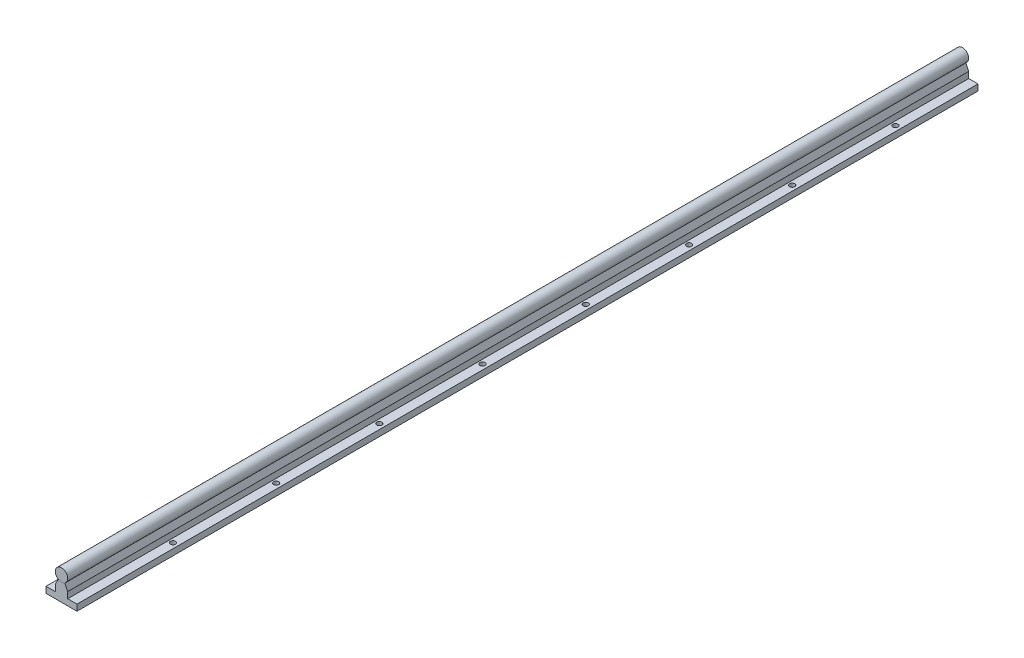
ISO-10303-21;
HEADER;
FILE_DESCRIPTION(('STEP AP214'),'2;1');
FILE_NAME('part.step','',(''),(''),'','','');
FILE_SCHEMA(('AUTOMOTIVE_DESIGN { 1 0 10303 214 1 1 1 1 }'));
ENDSEC;
DATA;
#1=APPLICATION_CONTEXT('core data for automotive mechanical design processes');
#2=APPLICATION_PROTOCOL_DEFINITION('international standard','automotive_design',2000,#1);
#3=PRODUCT_CONTEXT('',#1,'mechanical');
#4=PRODUCT('Part','Part','',(#3));
#5=PRODUCT_RELATED_PRODUCT_CATEGORY('part','',(#4));
#6=PRODUCT_DEFINITION_FORMATION('','',#4);
#7=PRODUCT_DEFINITION_CONTEXT('part definition',#1,'design');
#8=PRODUCT_DEFINITION('design','',#6,#7);
#9=PRODUCT_DEFINITION_SHAPE('','',#8);
#10=(LENGTH_UNIT() NAMED_UNIT(*) SI_UNIT(.MILLI.,.METRE.));
#11=(NAMED_UNIT(*) PLANE_ANGLE_UNIT() SI_UNIT($,.RADIAN.));
#12=(NAMED_UNIT(*) SI_UNIT($,.STERADIAN.) SOLID_ANGLE_UNIT());
#13=UNCERTAINTY_MEASURE_WITH_UNIT(LENGTH_MEASURE(1.E-05),#10,'distance_accuracy_value','');
#14=(GEOMETRIC_REPRESENTATION_CONTEXT(3) GLOBAL_UNCERTAINTY_ASSIGNED_CONTEXT((#13)) GLOBAL_UNIT_ASSIGNED_CONTEXT((#10,
#11,#12)) REPRESENTATION_CONTEXT('',''));
#15=CARTESIAN_POINT('',(0.,0.,0.));
#16=DIRECTION('',(0.,0.,1.));
#17=DIRECTION('',(1.,0.,0.));
#18=AXIS2_PLACEMENT_3D('',#15,#16,#17);
#19=CARTESIAN_POINT('',(0.,-23.,907.946962289385));
#20=DIRECTION('',(0.,1.,0.));
#21=DIRECTION('',(-1.,0.,0.));
#22=AXIS2_PLACEMENT_3D('',#19,#20,#21);
#23=PLANE('',#22);
#24=CARTESIAN_POINT('',(-10.,-23.,475.));
#25=DIRECTION('',(0.,-1.,0.));
#26=DIRECTION('',(0.,0.,-1.));
#27=AXIS2_PLACEMENT_3D('',#24,#25,#26);
#28=CIRCLE('',#27,2.5);
#29=CARTESIAN_POINT('',(-10.,-23.,472.5));
#30=VERTEX_POINT('',#29);
#31=EDGE_CURVE('E462',#30,#30,#28,.T.);
#32=ORIENTED_EDGE('',*,*,#31,.F.);
#33=EDGE_LOOP('',(#32));
#34=FACE_BOUND('',#33,.T.);
#35=CARTESIAN_POINT('',(9.99999999999999,-23.,375.));
#36=DIRECTION('',(0.,-1.,0.));
#37=DIRECTION('',(0.,0.,-1.));
#38=AXIS2_PLACEMENT_3D('',#35,#36,#37);
#39=CIRCLE('',#38,2.5);
#40=CARTESIAN_POINT('',(9.99999999999999,-23.,372.5));
#41=VERTEX_POINT('',#40);
#42=EDGE_CURVE('E468',#41,#41,#39,.T.);
#43=ORIENTED_EDGE('',*,*,#42,.F.);
#44=EDGE_LOOP('',(#43));
#45=FACE_BOUND('',#44,.T.);
#46=CARTESIAN_POINT('',(9.99999999999999,-23.,75.));
#47=DIRECTION('',(0.,-1.,0.));
#48=DIRECTION('',(0.,0.,-1.));
#49=AXIS2_PLACEMENT_3D('',#46,#47,#48);
#50=CIRCLE('',#49,2.5);
#51=CARTESIAN_POINT('',(9.99999999999999,-23.,72.5));
#52=VERTEX_POINT('',#51);
#53=EDGE_CURVE('E346',#52,#52,#50,.T.);
#54=ORIENTED_EDGE('',*,*,#53,.F.);
#55=EDGE_LOOP('',(#54));
#56=FACE_BOUND('',#55,.T.);
#57=CARTESIAN_POINT('',(-10.,-23.,75.));
#58=DIRECTION('',(0.,-1.,0.));
#59=DIRECTION('',(0.,0.,-1.));
#60=AXIS2_PLACEMENT_3D('',#57,#58,#59);
#61=CIRCLE('',#60,2.5);
#62=CARTESIAN_POINT('',(-10.,-23.,72.5));
#63=VERTEX_POINT('',#62);
#64=EDGE_CURVE('E345',#63,#63,#61,.T.);
#65=ORIENTED_EDGE('',*,*,#64,.F.);
#66=EDGE_LOOP('',(#65));
#67=FACE_BOUND('',#66,.T.);
#68=DIRECTION('',(1.,0.,0.));
#69=VECTOR('',#68,1.);
#70=CARTESIAN_POINT('',(0.,-23.,873.));
#71=LINE('',#70,#69);
#72=CARTESIAN_POINT('',(-15.,-23.,873.));
#73=VERTEX_POINT('',#72);
#74=CARTESIAN_POINT('',(15.,-23.,873.));
#75=VERTEX_POINT('',#74);
#76=EDGE_CURVE('E178',#73,#75,#71,.T.);
#77=ORIENTED_EDGE('',*,*,#76,.F.);
#78=DIRECTION('',(0.,0.,-1.));
#79=VECTOR('',#78,1.);
#80=CARTESIAN_POINT('',(-15.,-23.,907.946962289385));
#81=LINE('',#80,#79);
#82=CARTESIAN_POINT('',(-15.,-23.,0.));
#83=VERTEX_POINT('',#82);
#84=EDGE_CURVE('E205',#73,#83,#81,.T.);
#85=ORIENTED_EDGE('',*,*,#84,.T.);
#86=DIRECTION('',(1.,0.,0.));
#87=VECTOR('',#86,1.);
#88=CARTESIAN_POINT('',(0.,-23.,0.));
#89=LINE('',#88,#87);
#90=CARTESIAN_POINT('',(15.,-23.,0.));
#91=VERTEX_POINT('',#90);
#92=EDGE_CURVE('E207',#83,#91,#89,.T.);
#93=ORIENTED_EDGE('',*,*,#92,.T.);
#94=DIRECTION('',(0.,0.,-1.));
#95=VECTOR('',#94,1.);
#96=CARTESIAN_POINT('',(15.,-23.,907.946962289385));
#97=LINE('',#96,#95);
#98=EDGE_CURVE('E208',#75,#91,#97,.T.);
#99=ORIENTED_EDGE('',*,*,#98,.F.);
#100=EDGE_LOOP('',(#77,#85,#93,#99));
#101=FACE_BOUND('',#100,.T.);
#102=CARTESIAN_POINT('',(-10.,-23.,175.));
#103=DIRECTION('',(0.,-1.,0.));
#104=DIRECTION('',(0.,0.,-1.));
#105=AXIS2_PLACEMENT_3D('',#102,#103,#104);
#106=CIRCLE('',#105,2.5);
#107=CARTESIAN_POINT('',(-10.,-23.,172.5));
#108=VERTEX_POINT('',#107);
#109=EDGE_CURVE('E492',#108,#108,#106,.T.);
#110=ORIENTED_EDGE('',*,*,#109,.F.);
#111=EDGE_LOOP('',(#110));
#112=FACE_BOUND('',#111,.T.);
#113=CARTESIAN_POINT('',(9.99999999999999,-23.,175.));
#114=DIRECTION('',(0.,-1.,0.));
#115=DIRECTION('',(0.,0.,-1.));
#116=AXIS2_PLACEMENT_3D('',#113,#114,#115);
#117=CIRCLE('',#116,2.5);
#118=CARTESIAN_POINT('',(9.99999999999999,-23.,172.5));
#119=VERTEX_POINT('',#118);
#120=EDGE_CURVE('E488',#119,#119,#117,.T.);
#121=ORIENTED_EDGE('',*,*,#120,.F.);
#122=EDGE_LOOP('',(#121));
#123=FACE_BOUND('',#122,.T.);
#124=CARTESIAN_POINT('',(-10.,-23.,275.));
#125=DIRECTION('',(0.,-1.,0.));
#126=DIRECTION('',(0.,0.,-1.));
#127=AXIS2_PLACEMENT_3D('',#124,#125,#126);
#128=CIRCLE('',#127,2.5);
#129=CARTESIAN_POINT('',(-10.,-23.,272.5));
#130=VERTEX_POINT('',#129);
#131=EDGE_CURVE('E482',#130,#130,#128,.T.);
#132=ORIENTED_EDGE('',*,*,#131,.F.);
#133=EDGE_LOOP('',(#132));
#134=FACE_BOUND('',#133,.T.);
#135=CARTESIAN_POINT('',(9.99999999999999,-23.,275.));
#136=DIRECTION('',(0.,-1.,0.));
#137=DIRECTION('',(0.,0.,-1.));
#138=AXIS2_PLACEMENT_3D('',#135,#136,#137);
#139=CIRCLE('',#138,2.5);
#140=CARTESIAN_POINT('',(9.99999999999999,-23.,272.5));
#141=VERTEX_POINT('',#140);
#142=EDGE_CURVE('E478',#141,#141,#139,.T.);
#143=ORIENTED_EDGE('',*,*,#142,.F.);
#144=EDGE_LOOP('',(#143));
#145=FACE_BOUND('',#144,.T.);
#146=CARTESIAN_POINT('',(-10.,-23.,375.));
#147=DIRECTION('',(0.,-1.,0.));
#148=DIRECTION('',(0.,0.,-1.));
#149=AXIS2_PLACEMENT_3D('',#146,#147,#148);
#150=CIRCLE('',#149,2.5);
#151=CARTESIAN_POINT('',(-10.,-23.,372.5));
#152=VERTEX_POINT('',#151);
#153=EDGE_CURVE('E472',#152,#152,#150,.T.);
#154=ORIENTED_EDGE('',*,*,#153,.F.);
#155=EDGE_LOOP('',(#154));
#156=FACE_BOUND('',#155,.T.);
#157=CARTESIAN_POINT('',(9.99999999999999,-23.,475.));
#158=DIRECTION('',(0.,-1.,0.));
#159=DIRECTION('',(0.,0.,-1.));
#160=AXIS2_PLACEMENT_3D('',#157,#158,#159);
#161=CIRCLE('',#160,2.5);
#162=CARTESIAN_POINT('',(9.99999999999999,-23.,472.5));
#163=VERTEX_POINT('',#162);
#164=EDGE_CURVE('E458',#163,#163,#161,.T.);
#165=ORIENTED_EDGE('',*,*,#164,.F.);
#166=EDGE_LOOP('',(#165));
#167=FACE_BOUND('',#166,.T.);
#168=CARTESIAN_POINT('',(-10.,-23.,575.));
#169=DIRECTION('',(0.,-1.,0.));
#170=DIRECTION('',(0.,0.,-1.));
#171=AXIS2_PLACEMENT_3D('',#168,#169,#170);
#172=CIRCLE('',#171,2.5);
#173=CARTESIAN_POINT('',(-10.,-23.,572.5));
#174=VERTEX_POINT('',#173);
#175=EDGE_CURVE('E452',#174,#174,#172,.T.);
#176=ORIENTED_EDGE('',*,*,#175,.F.);
#177=EDGE_LOOP('',(#176));
#178=FACE_BOUND('',#177,.T.);
#179=CARTESIAN_POINT('',(9.99999999999999,-23.,575.));
#180=DIRECTION('',(0.,-1.,0.));
#181=DIRECTION('',(0.,0.,-1.));
#182=AXIS2_PLACEMENT_3D('',#179,#180,#181);
#183=CIRCLE('',#182,2.5);
#184=CARTESIAN_POINT('',(9.99999999999999,-23.,572.5));
#185=VERTEX_POINT('',#184);
#186=EDGE_CURVE('E448',#185,#185,#183,.T.);
#187=ORIENTED_EDGE('',*,*,#186,.F.);
#188=EDGE_LOOP('',(#187));
#189=FACE_BOUND('',#188,.T.);
#190=CARTESIAN_POINT('',(-10.,-23.,675.));
#191=DIRECTION('',(0.,-1.,0.));
#192=DIRECTION('',(0.,0.,-1.));
#193=AXIS2_PLACEMENT_3D('',#190,#191,#192);
#194=CIRCLE('',#193,2.5);
#195=CARTESIAN_POINT('',(-10.,-23.,672.5));
#196=VERTEX_POINT('',#195);
#197=EDGE_CURVE('E442',#196,#196,#194,.T.);
#198=ORIENTED_EDGE('',*,*,#197,.F.);
#199=EDGE_LOOP('',(#198));
#200=FACE_BOUND('',#199,.T.);
#201=CARTESIAN_POINT('',(9.99999999999999,-23.,675.));
#202=DIRECTION('',(0.,-1.,0.));
#203=DIRECTION('',(0.,0.,-1.));
#204=AXIS2_PLACEMENT_3D('',#201,#202,#203);
#205=CIRCLE('',#204,2.5);
#206=CARTESIAN_POINT('',(9.99999999999999,-23.,672.5));
#207=VERTEX_POINT('',#206);
#208=EDGE_CURVE('E438',#207,#207,#205,.T.);
#209=ORIENTED_EDGE('',*,*,#208,.F.);
#210=EDGE_LOOP('',(#209));
#211=FACE_BOUND('',#210,.T.);
#212=CARTESIAN_POINT('',(-10.,-23.,775.));
#213=DIRECTION('',(0.,-1.,0.));
#214=DIRECTION('',(0.,0.,-1.));
#215=AXIS2_PLACEMENT_3D('',#212,#213,#214);
#216=CIRCLE('',#215,2.5);
#217=CARTESIAN_POINT('',(-10.,-23.,772.5));
#218=VERTEX_POINT('',#217);
#219=EDGE_CURVE('E429',#218,#218,#216,.T.);
#220=ORIENTED_EDGE('',*,*,#219,.F.);
#221=EDGE_LOOP('',(#220));
#222=FACE_BOUND('',#221,.T.);
#223=CARTESIAN_POINT('',(9.99999999999999,-23.,775.));
#224=DIRECTION('',(0.,-1.,0.));
#225=DIRECTION('',(0.,0.,-1.));
#226=AXIS2_PLACEMENT_3D('',#223,#224,#225);
#227=CIRCLE('',#226,2.5);
#228=CARTESIAN_POINT('',(9.99999999999999,-23.,772.5));
#229=VERTEX_POINT('',#228);
#230=EDGE_CURVE('E428',#229,#229,#227,.T.);
#231=ORIENTED_EDGE('',*,*,#230,.F.);
#232=EDGE_LOOP('',(#231));
#233=FACE_BOUND('',#232,.T.);
#234=ADVANCED_FACE('F51',(#34,#45,#56,#67,#101,#112,#123,#134,#145,#156,#167,#178,#189,#200,
#211,#222,#233),#23,.F.);
#235=CARTESIAN_POINT('',(0.,0.,907.946962289385));
#236=DIRECTION('',(0.,0.,-1.));
#237=DIRECTION('',(-1.,0.,0.));
#238=AXIS2_PLACEMENT_3D('',#235,#236,#237);
#239=CYLINDRICAL_SURFACE('',#238,6.);
#240=DIRECTION('',(0.,0.,-1.));
#241=VECTOR('',#240,1.);
#242=CARTESIAN_POINT('',(-3.2,-5.07543101617981,907.946962289385));
#243=LINE('',#242,#241);
#244=CARTESIAN_POINT('',(-3.2,-5.07543101617981,873.));
#245=VERTEX_POINT('',#244);
#246=CARTESIAN_POINT('',(-3.2,-5.07543101617981,0.));
#247=VERTEX_POINT('',#246);
#248=EDGE_CURVE('E122',#245,#247,#243,.T.);
#249=ORIENTED_EDGE('',*,*,#248,.F.);
#250=CARTESIAN_POINT('',(0.,0.,873.));
#251=DIRECTION('',(0.,0.,1.));
#252=DIRECTION('',(1.,0.,0.));
#253=AXIS2_PLACEMENT_3D('',#250,#251,#252);
#254=CIRCLE('',#253,6.);
#255=CARTESIAN_POINT('',(3.2,-5.07543101617981,873.));
#256=VERTEX_POINT('',#255);
#257=EDGE_CURVE('E196',#245,#256,#254,.T.);
#258=ORIENTED_EDGE('',*,*,#257,.T.);
#259=DIRECTION('',(0.,0.,-1.));
#260=VECTOR('',#259,1.);
#261=CARTESIAN_POINT('',(3.2,-5.07543101617981,907.946962289385));
#262=LINE('',#261,#260);
#263=CARTESIAN_POINT('',(3.2,-5.07543101617981,0.));
#264=VERTEX_POINT('',#263);
#265=EDGE_CURVE('E55',#256,#264,#262,.T.);
#266=ORIENTED_EDGE('',*,*,#265,.T.);
#267=CARTESIAN_POINT('',(0.,0.,0.));
#268=DIRECTION('',(0.,0.,1.));
#269=DIRECTION('',(1.,0.,0.));
#270=AXIS2_PLACEMENT_3D('',#267,#268,#269);
#271=CIRCLE('',#270,6.);
#272=EDGE_CURVE('E210',#247,#264,#271,.T.);
#273=ORIENTED_EDGE('',*,*,#272,.F.);
#274=EDGE_LOOP('',(#249,#258,#266,#273));
#275=FACE_BOUND('',#274,.T.);
#276=ADVANCED_FACE('F240',(#275),#239,.F.);
#277=CARTESIAN_POINT('',(-0.684457312309336,0.319167686410031,907.946962289385));
#278=DIRECTION('',(-0.90630778703665,0.4226182617407,0.));
#279=DIRECTION('',(-0.4226182617407,-0.90630778703665,0.));
#280=AXIS2_PLACEMENT_3D('',#277,#278,#279);
#281=PLANE('',#280);
#282=DIRECTION('',(0.,0.,-1.));
#283=VECTOR('',#282,1.);
#284=CARTESIAN_POINT('',(-5.96267188842293,-11.,907.946962289385));
#285=LINE('',#284,#283);
#286=CARTESIAN_POINT('',(-5.96267188842293,-11.,873.));
#287=VERTEX_POINT('',#286);
#288=CARTESIAN_POINT('',(-5.96267188842293,-11.,0.));
#289=VERTEX_POINT('',#288);
#290=EDGE_CURVE('E194',#287,#289,#285,.T.);
#291=ORIENTED_EDGE('',*,*,#290,.F.);
#292=DIRECTION('',(0.4226182617407,0.90630778703665,0.));
#293=VECTOR('',#292,1.);
#294=CARTESIAN_POINT('',(-0.684457312309336,0.319167686410031,873.));
#295=LINE('',#294,#293);
#296=EDGE_CURVE('E129',#287,#245,#295,.T.);
#297=ORIENTED_EDGE('',*,*,#296,.T.);
#298=ORIENTED_EDGE('',*,*,#248,.T.);
#299=DIRECTION('',(0.4226182617407,0.90630778703665,0.));
#300=VECTOR('',#299,1.);
#301=CARTESIAN_POINT('',(-0.684457312309336,0.319167686410031,0.));
#302=LINE('',#301,#300);
#303=EDGE_CURVE('E191',#289,#247,#302,.T.);
#304=ORIENTED_EDGE('',*,*,#303,.F.);
#305=EDGE_LOOP('',(#291,#297,#298,#304));
#306=FACE_BOUND('',#305,.T.);
#307=ADVANCED_FACE('F258',(#306),#281,.T.);
#308=CARTESIAN_POINT('',(0.,-11.,907.946962289385));
#309=DIRECTION('',(0.,1.,0.));
#310=DIRECTION('',(0.,0.,1.));
#311=AXIS2_PLACEMENT_3D('',#308,#309,#310);
#312=PLANE('',#311);
#313=DIRECTION('',(0.,0.,-1.));
#314=VECTOR('',#313,1.);
#315=CARTESIAN_POINT('',(-6.,-11.,907.946962289385));
#316=LINE('',#315,#314);
#317=CARTESIAN_POINT('',(-6.,-11.,873.));
#318=VERTEX_POINT('',#317);
#319=CARTESIAN_POINT('',(-6.,-11.,0.));
#320=VERTEX_POINT('',#319);
#321=EDGE_CURVE('E201',#318,#320,#316,.T.);
#322=ORIENTED_EDGE('',*,*,#321,.F.);
#323=DIRECTION('',(1.,0.,0.));
#324=VECTOR('',#323,1.);
#325=CARTESIAN_POINT('',(0.,-11.,873.));
#326=LINE('',#325,#324);
#327=EDGE_CURVE('E192',#318,#287,#326,.T.);
#328=ORIENTED_EDGE('',*,*,#327,.T.);
#329=ORIENTED_EDGE('',*,*,#290,.T.);
#330=DIRECTION('',(1.,0.,0.));
#331=VECTOR('',#330,1.);
#332=CARTESIAN_POINT('',(0.,-11.,0.));
#333=LINE('',#332,#331);
#334=EDGE_CURVE('E230',#320,#289,#333,.T.);
#335=ORIENTED_EDGE('',*,*,#334,.F.);
#336=EDGE_LOOP('',(#322,#328,#329,#335));
#337=FACE_BOUND('',#336,.T.);
#338=ADVANCED_FACE('F275',(#337),#312,.T.);
#339=CARTESIAN_POINT('',(-6.,0.,907.946962289385));
#340=DIRECTION('',(1.,0.,0.));
#341=DIRECTION('',(0.,1.,0.));
#342=AXIS2_PLACEMENT_3D('',#339,#340,#341);
#343=PLANE('',#342);
#344=DIRECTION('',(0.,-1.,0.));
#345=VECTOR('',#344,1.);
#346=CARTESIAN_POINT('',(-6.,0.,873.));
#347=LINE('',#346,#345);
#348=CARTESIAN_POINT('',(-6.,-17.,873.));
#349=VERTEX_POINT('',#348);
#350=EDGE_CURVE('E181',#318,#349,#347,.T.);
#351=ORIENTED_EDGE('',*,*,#350,.F.);
#352=ORIENTED_EDGE('',*,*,#321,.T.);
#353=DIRECTION('',(0.,-1.,0.));
#354=VECTOR('',#353,1.);
#355=CARTESIAN_POINT('',(-6.,0.,0.));
#356=LINE('',#355,#354);
#357=CARTESIAN_POINT('',(-6.,-17.,0.));
#358=VERTEX_POINT('',#357);
#359=EDGE_CURVE('E188',#320,#358,#356,.T.);
#360=ORIENTED_EDGE('',*,*,#359,.T.);
#361=DIRECTION('',(0.,0.,-1.));
#362=VECTOR('',#361,1.);
#363=CARTESIAN_POINT('',(-6.,-17.,907.946962289385));
#364=LINE('',#363,#362);
#365=EDGE_CURVE('E185',#349,#358,#364,.T.);
#366=ORIENTED_EDGE('',*,*,#365,.F.);
#367=EDGE_LOOP('',(#351,#352,#360,#366));
#368=FACE_BOUND('',#367,.T.);
#369=ADVANCED_FACE('F271',(#368),#343,.F.);
#370=CARTESIAN_POINT('',(0.,-17.,907.946962289385));
#371=DIRECTION('',(0.,1.,0.));
#372=DIRECTION('',(0.,0.,1.));
#373=AXIS2_PLACEMENT_3D('',#370,#371,#372);
#374=PLANE('',#373);
#375=CARTESIAN_POINT('',(-10.,-17.,775.));
#376=DIRECTION('',(0.,1.,0.));
#377=DIRECTION('',(0.,0.,1.));
#378=AXIS2_PLACEMENT_3D('',#375,#376,#377);
#379=CIRCLE('',#378,2.5);
#380=CARTESIAN_POINT('',(-10.,-17.,777.5));
#381=VERTEX_POINT('',#380);
#382=EDGE_CURVE('E432',#381,#381,#379,.T.);
#383=ORIENTED_EDGE('',*,*,#382,.F.);
#384=EDGE_LOOP('',(#383));
#385=FACE_BOUND('',#384,.T.);
#386=CARTESIAN_POINT('',(-10.,-17.,675.));
#387=DIRECTION('',(0.,1.,0.));
#388=DIRECTION('',(0.,0.,1.));
#389=AXIS2_PLACEMENT_3D('',#386,#387,#388);
#390=CIRCLE('',#389,2.5);
#391=CARTESIAN_POINT('',(-10.,-17.,677.5));
#392=VERTEX_POINT('',#391);
#393=EDGE_CURVE('E445',#392,#392,#390,.T.);
#394=ORIENTED_EDGE('',*,*,#393,.F.);
#395=EDGE_LOOP('',(#394));
#396=FACE_BOUND('',#395,.T.);
#397=CARTESIAN_POINT('',(-10.,-17.,575.));
#398=DIRECTION('',(0.,1.,0.));
#399=DIRECTION('',(0.,0.,1.));
#400=AXIS2_PLACEMENT_3D('',#397,#398,#399);
#401=CIRCLE('',#400,2.5);
#402=CARTESIAN_POINT('',(-10.,-17.,577.5));
#403=VERTEX_POINT('',#402);
#404=EDGE_CURVE('E455',#403,#403,#401,.T.);
#405=ORIENTED_EDGE('',*,*,#404,.F.);
#406=EDGE_LOOP('',(#405));
#407=FACE_BOUND('',#406,.T.);
#408=CARTESIAN_POINT('',(-10.,-17.,475.));
#409=DIRECTION('',(0.,1.,0.));
#410=DIRECTION('',(0.,0.,1.));
#411=AXIS2_PLACEMENT_3D('',#408,#409,#410);
#412=CIRCLE('',#411,2.5);
#413=CARTESIAN_POINT('',(-10.,-17.,477.5));
#414=VERTEX_POINT('',#413);
#415=EDGE_CURVE('E465',#414,#414,#412,.T.);
#416=ORIENTED_EDGE('',*,*,#415,.F.);
#417=EDGE_LOOP('',(#416));
#418=FACE_BOUND('',#417,.T.);
#419=CARTESIAN_POINT('',(-10.,-17.,375.));
#420=DIRECTION('',(0.,1.,0.));
#421=DIRECTION('',(0.,0.,1.));
#422=AXIS2_PLACEMENT_3D('',#419,#420,#421);
#423=CIRCLE('',#422,2.5);
#424=CARTESIAN_POINT('',(-10.,-17.,377.5));
#425=VERTEX_POINT('',#424);
#426=EDGE_CURVE('E475',#425,#425,#423,.T.);
#427=ORIENTED_EDGE('',*,*,#426,.F.);
#428=EDGE_LOOP('',(#427));
#429=FACE_BOUND('',#428,.T.);
#430=CARTESIAN_POINT('',(-10.,-17.,275.));
#431=DIRECTION('',(0.,1.,0.));
#432=DIRECTION('',(0.,0.,1.));
#433=AXIS2_PLACEMENT_3D('',#430,#431,#432);
#434=CIRCLE('',#433,2.5);
#435=CARTESIAN_POINT('',(-10.,-17.,277.5));
#436=VERTEX_POINT('',#435);
#437=EDGE_CURVE('E485',#436,#436,#434,.T.);
#438=ORIENTED_EDGE('',*,*,#437,.F.);
#439=EDGE_LOOP('',(#438));
#440=FACE_BOUND('',#439,.T.);
#441=CARTESIAN_POINT('',(-10.,-17.,175.));
#442=DIRECTION('',(0.,1.,0.));
#443=DIRECTION('',(0.,0.,1.));
#444=AXIS2_PLACEMENT_3D('',#441,#442,#443);
#445=CIRCLE('',#444,2.5);
#446=CARTESIAN_POINT('',(-10.,-17.,177.5));
#447=VERTEX_POINT('',#446);
#448=EDGE_CURVE('E351',#447,#447,#445,.T.);
#449=ORIENTED_EDGE('',*,*,#448,.F.);
#450=EDGE_LOOP('',(#449));
#451=FACE_BOUND('',#450,.T.);
#452=CARTESIAN_POINT('',(-10.,-17.,75.));
#453=DIRECTION('',(0.,1.,0.));
#454=DIRECTION('',(0.,0.,1.));
#455=AXIS2_PLACEMENT_3D('',#452,#453,#454);
#456=CIRCLE('',#455,2.5);
#457=CARTESIAN_POINT('',(-10.,-17.,77.5));
#458=VERTEX_POINT('',#457);
#459=EDGE_CURVE('E197',#458,#458,#456,.T.);
#460=ORIENTED_EDGE('',*,*,#459,.F.);
#461=EDGE_LOOP('',(#460));
#462=FACE_BOUND('',#461,.T.);
#463=DIRECTION('',(0.,0.,-1.));
#464=VECTOR('',#463,1.);
#465=CARTESIAN_POINT('',(-15.,-17.,907.946962289385));
#466=LINE('',#465,#464);
#467=CARTESIAN_POINT('',(-15.,-17.,873.));
#468=VERTEX_POINT('',#467);
#469=CARTESIAN_POINT('',(-15.,-17.,0.));
#470=VERTEX_POINT('',#469);
#471=EDGE_CURVE('E184',#468,#470,#466,.T.);
#472=ORIENTED_EDGE('',*,*,#471,.F.);
#473=DIRECTION('',(1.,0.,0.));
#474=VECTOR('',#473,1.);
#475=CARTESIAN_POINT('',(0.,-17.,873.));
#476=LINE('',#475,#474);
#477=EDGE_CURVE('E186',#468,#349,#476,.T.);
#478=ORIENTED_EDGE('',*,*,#477,.T.);
#479=ORIENTED_EDGE('',*,*,#365,.T.);
#480=DIRECTION('',(1.,0.,0.));
#481=VECTOR('',#480,1.);
#482=CARTESIAN_POINT('',(0.,-17.,0.));
#483=LINE('',#482,#481);
#484=EDGE_CURVE('E227',#470,#358,#483,.T.);
#485=ORIENTED_EDGE('',*,*,#484,.F.);
#486=EDGE_LOOP('',(#472,#478,#479,#485));
#487=FACE_BOUND('',#486,.T.);
#488=ADVANCED_FACE('F268',(#385,#396,#407,#418,#429,#440,#451,#462,#487),#374,.T.);
#489=CARTESIAN_POINT('',(-15.,0.,907.946962289385));
#490=DIRECTION('',(-1.,0.,0.));
#491=DIRECTION('',(0.,0.,1.));
#492=AXIS2_PLACEMENT_3D('',#489,#490,#491);
#493=PLANE('',#492);
#494=ORIENTED_EDGE('',*,*,#84,.F.);
#495=DIRECTION('',(0.,1.,0.));
#496=VECTOR('',#495,1.);
#497=CARTESIAN_POINT('',(-15.,0.,873.));
#498=LINE('',#497,#496);
#499=EDGE_CURVE('E182',#73,#468,#498,.T.);
#500=ORIENTED_EDGE('',*,*,#499,.T.);
#501=ORIENTED_EDGE('',*,*,#471,.T.);
#502=DIRECTION('',(0.,1.,0.));
#503=VECTOR('',#502,1.);
#504=CARTESIAN_POINT('',(-15.,0.,0.));
#505=LINE('',#504,#503);
#506=EDGE_CURVE('E220',#83,#470,#505,.T.);
#507=ORIENTED_EDGE('',*,*,#506,.F.);
#508=EDGE_LOOP('',(#494,#500,#501,#507));
#509=FACE_BOUND('',#508,.T.);
#510=ADVANCED_FACE('F265',(#509),#493,.T.);
#511=CARTESIAN_POINT('',(15.,0.,907.946962289385));
#512=DIRECTION('',(-1.,0.,0.));
#513=DIRECTION('',(0.,-1.,0.));
#514=AXIS2_PLACEMENT_3D('',#511,#512,#513);
#515=PLANE('',#514);
#516=DIRECTION('',(0.,1.,0.));
#517=VECTOR('',#516,1.);
#518=CARTESIAN_POINT('',(15.,0.,873.));
#519=LINE('',#518,#517);
#520=CARTESIAN_POINT('',(15.,-17.,873.));
#521=VERTEX_POINT('',#520);
#522=EDGE_CURVE('E153',#75,#521,#519,.T.);
#523=ORIENTED_EDGE('',*,*,#522,.F.);
#524=ORIENTED_EDGE('',*,*,#98,.T.);
#525=DIRECTION('',(0.,1.,0.));
#526=VECTOR('',#525,1.);
#527=CARTESIAN_POINT('',(15.,0.,0.));
#528=LINE('',#527,#526);
#529=CARTESIAN_POINT('',(15.,-17.,0.));
#530=VERTEX_POINT('',#529);
#531=EDGE_CURVE('E176',#91,#530,#528,.T.);
#532=ORIENTED_EDGE('',*,*,#531,.T.);
#533=DIRECTION('',(0.,0.,-1.));
#534=VECTOR('',#533,1.);
#535=CARTESIAN_POINT('',(15.,-17.,907.946962289385));
#536=LINE('',#535,#534);
#537=EDGE_CURVE('E169',#521,#530,#536,.T.);
#538=ORIENTED_EDGE('',*,*,#537,.F.);
#539=EDGE_LOOP('',(#523,#524,#532,#538));
#540=FACE_BOUND('',#539,.T.);
#541=ADVANCED_FACE('F263',(#540),#515,.F.);
#542=CARTESIAN_POINT('',(0.,-17.,907.946962289385));
#543=DIRECTION('',(0.,1.,0.));
#544=DIRECTION('',(-1.,0.,0.));
#545=AXIS2_PLACEMENT_3D('',#542,#543,#544);
#546=PLANE('',#545);
#547=CARTESIAN_POINT('',(9.99999999999999,-17.,775.));
#548=DIRECTION('',(0.,1.,0.));
#549=DIRECTION('',(-1.,0.,0.));
#550=AXIS2_PLACEMENT_3D('',#547,#548,#549);
#551=CIRCLE('',#550,2.5);
#552=CARTESIAN_POINT('',(7.5,-17.,775.));
#553=VERTEX_POINT('',#552);
#554=EDGE_CURVE('E316',#553,#553,#551,.T.);
#555=ORIENTED_EDGE('',*,*,#554,.F.);
#556=EDGE_LOOP('',(#555));
#557=FACE_BOUND('',#556,.T.);
#558=CARTESIAN_POINT('',(9.99999999999999,-17.,675.));
#559=DIRECTION('',(0.,1.,0.));
#560=DIRECTION('',(-1.,0.,0.));
#561=AXIS2_PLACEMENT_3D('',#558,#559,#560);
#562=CIRCLE('',#561,2.5);
#563=CARTESIAN_POINT('',(7.5,-17.,675.));
#564=VERTEX_POINT('',#563);
#565=EDGE_CURVE('E320',#564,#564,#562,.T.);
#566=ORIENTED_EDGE('',*,*,#565,.F.);
#567=EDGE_LOOP('',(#566));
#568=FACE_BOUND('',#567,.T.);
#569=CARTESIAN_POINT('',(9.99999999999999,-17.,575.));
#570=DIRECTION('',(0.,1.,0.));
#571=DIRECTION('',(-1.,0.,0.));
#572=AXIS2_PLACEMENT_3D('',#569,#570,#571);
#573=CIRCLE('',#572,2.5);
#574=CARTESIAN_POINT('',(7.5,-17.,575.));
#575=VERTEX_POINT('',#574);
#576=EDGE_CURVE('E324',#575,#575,#573,.T.);
#577=ORIENTED_EDGE('',*,*,#576,.F.);
#578=EDGE_LOOP('',(#577));
#579=FACE_BOUND('',#578,.T.);
#580=CARTESIAN_POINT('',(9.99999999999999,-17.,475.));
#581=DIRECTION('',(0.,1.,0.));
#582=DIRECTION('',(-1.,0.,0.));
#583=AXIS2_PLACEMENT_3D('',#580,#581,#582);
#584=CIRCLE('',#583,2.5);
#585=CARTESIAN_POINT('',(7.5,-17.,475.));
#586=VERTEX_POINT('',#585);
#587=EDGE_CURVE('E328',#586,#586,#584,.T.);
#588=ORIENTED_EDGE('',*,*,#587,.F.);
#589=EDGE_LOOP('',(#588));
#590=FACE_BOUND('',#589,.T.);
#591=CARTESIAN_POINT('',(9.99999999999999,-17.,375.));
#592=DIRECTION('',(0.,1.,0.));
#593=DIRECTION('',(-1.,0.,0.));
#594=AXIS2_PLACEMENT_3D('',#591,#592,#593);
#595=CIRCLE('',#594,2.5);
#596=CARTESIAN_POINT('',(7.5,-17.,375.));
#597=VERTEX_POINT('',#596);
#598=EDGE_CURVE('E332',#597,#597,#595,.T.);
#599=ORIENTED_EDGE('',*,*,#598,.F.);
#600=EDGE_LOOP('',(#599));
#601=FACE_BOUND('',#600,.T.);
#602=CARTESIAN_POINT('',(9.99999999999999,-17.,275.));
#603=DIRECTION('',(0.,1.,0.));
#604=DIRECTION('',(-1.,0.,0.));
#605=AXIS2_PLACEMENT_3D('',#602,#603,#604);
#606=CIRCLE('',#605,2.5);
#607=CARTESIAN_POINT('',(7.5,-17.,275.));
#608=VERTEX_POINT('',#607);
#609=EDGE_CURVE('E336',#608,#608,#606,.T.);
#610=ORIENTED_EDGE('',*,*,#609,.F.);
#611=EDGE_LOOP('',(#610));
#612=FACE_BOUND('',#611,.T.);
#613=CARTESIAN_POINT('',(9.99999999999999,-17.,175.));
#614=DIRECTION('',(0.,1.,0.));
#615=DIRECTION('',(-1.,0.,0.));
#616=AXIS2_PLACEMENT_3D('',#613,#614,#615);
#617=CIRCLE('',#616,2.5);
#618=CARTESIAN_POINT('',(7.5,-17.,175.));
#619=VERTEX_POINT('',#618);
#620=EDGE_CURVE('E340',#619,#619,#617,.T.);
#621=ORIENTED_EDGE('',*,*,#620,.F.);
#622=EDGE_LOOP('',(#621));
#623=FACE_BOUND('',#622,.T.);
#624=CARTESIAN_POINT('',(9.99999999999999,-17.,75.));
#625=DIRECTION('',(0.,1.,0.));
#626=DIRECTION('',(-1.,0.,0.));
#627=AXIS2_PLACEMENT_3D('',#624,#625,#626);
#628=CIRCLE('',#627,2.5);
#629=CARTESIAN_POINT('',(7.5,-17.,75.));
#630=VERTEX_POINT('',#629);
#631=EDGE_CURVE('E343',#630,#630,#628,.T.);
#632=ORIENTED_EDGE('',*,*,#631,.F.);
#633=EDGE_LOOP('',(#632));
#634=FACE_BOUND('',#633,.T.);
#635=DIRECTION('',(0.,0.,-1.));
#636=VECTOR('',#635,1.);
#637=CARTESIAN_POINT('',(6.,-17.,907.946962289385));
#638=LINE('',#637,#636);
#639=CARTESIAN_POINT('',(6.,-17.,873.));
#640=VERTEX_POINT('',#639);
#641=CARTESIAN_POINT('',(6.,-17.,0.));
#642=VERTEX_POINT('',#641);
#643=EDGE_CURVE('E163',#640,#642,#638,.T.);
#644=ORIENTED_EDGE('',*,*,#643,.F.);
#645=DIRECTION('',(1.,0.,0.));
#646=VECTOR('',#645,1.);
#647=CARTESIAN_POINT('',(0.,-17.,873.));
#648=LINE('',#647,#646);
#649=EDGE_CURVE('E168',#640,#521,#648,.T.);
#650=ORIENTED_EDGE('',*,*,#649,.T.);
#651=ORIENTED_EDGE('',*,*,#537,.T.);
#652=DIRECTION('',(1.,0.,0.));
#653=VECTOR('',#652,1.);
#654=CARTESIAN_POINT('',(0.,-17.,0.));
#655=LINE('',#654,#653);
#656=EDGE_CURVE('E217',#642,#530,#655,.T.);
#657=ORIENTED_EDGE('',*,*,#656,.F.);
#658=EDGE_LOOP('',(#644,#650,#651,#657));
#659=FACE_BOUND('',#658,.T.);
#660=ADVANCED_FACE('F304',(#557,#568,#579,#590,#601,#612,#623,#634,#659),#546,.T.);
#661=CARTESIAN_POINT('',(6.,0.,907.946962289385));
#662=DIRECTION('',(1.,0.,0.));
#663=DIRECTION('',(0.,1.,0.));
#664=AXIS2_PLACEMENT_3D('',#661,#662,#663);
#665=PLANE('',#664);
#666=DIRECTION('',(0.,0.,-1.));
#667=VECTOR('',#666,1.);
#668=CARTESIAN_POINT('',(6.,-11.,907.946962289385));
#669=LINE('',#668,#667);
#670=CARTESIAN_POINT('',(6.,-11.,873.));
#671=VERTEX_POINT('',#670);
#672=CARTESIAN_POINT('',(6.,-11.,0.));
#673=VERTEX_POINT('',#672);
#674=EDGE_CURVE('E149',#671,#673,#669,.T.);
#675=ORIENTED_EDGE('',*,*,#674,.F.);
#676=DIRECTION('',(0.,-1.,0.));
#677=VECTOR('',#676,1.);
#678=CARTESIAN_POINT('',(6.,0.,873.));
#679=LINE('',#678,#677);
#680=EDGE_CURVE('E158',#671,#640,#679,.T.);
#681=ORIENTED_EDGE('',*,*,#680,.T.);
#682=ORIENTED_EDGE('',*,*,#643,.T.);
#683=DIRECTION('',(0.,-1.,0.));
#684=VECTOR('',#683,1.);
#685=CARTESIAN_POINT('',(6.,0.,0.));
#686=LINE('',#685,#684);
#687=EDGE_CURVE('E161',#673,#642,#686,.T.);
#688=ORIENTED_EDGE('',*,*,#687,.F.);
#689=EDGE_LOOP('',(#675,#681,#682,#688));
#690=FACE_BOUND('',#689,.T.);
#691=ADVANCED_FACE('F157',(#690),#665,.T.);
#692=CARTESIAN_POINT('',(0.,-11.,907.946962289385));
#693=DIRECTION('',(0.,-1.,0.));
#694=DIRECTION('',(0.,0.,-1.));
#695=AXIS2_PLACEMENT_3D('',#692,#693,#694);
#696=PLANE('',#695);
#697=DIRECTION('',(-1.,0.,0.));
#698=VECTOR('',#697,1.);
#699=CARTESIAN_POINT('',(0.,-11.,873.));
#700=LINE('',#699,#698);
#701=CARTESIAN_POINT('',(5.96267188842294,-11.,873.));
#702=VERTEX_POINT('',#701);
#703=EDGE_CURVE('E60',#671,#702,#700,.T.);
#704=ORIENTED_EDGE('',*,*,#703,.F.);
#705=ORIENTED_EDGE('',*,*,#674,.T.);
#706=DIRECTION('',(-1.,0.,0.));
#707=VECTOR('',#706,1.);
#708=CARTESIAN_POINT('',(0.,-11.,0.));
#709=LINE('',#708,#707);
#710=CARTESIAN_POINT('',(5.96267188842294,-11.,0.));
#711=VERTEX_POINT('',#710);
#712=EDGE_CURVE('E162',#673,#711,#709,.T.);
#713=ORIENTED_EDGE('',*,*,#712,.T.);
#714=DIRECTION('',(0.,0.,-1.));
#715=VECTOR('',#714,1.);
#716=CARTESIAN_POINT('',(5.96267188842294,-11.,907.946962289385));
#717=LINE('',#716,#715);
#718=EDGE_CURVE('E73',#702,#711,#717,.T.);
#719=ORIENTED_EDGE('',*,*,#718,.F.);
#720=EDGE_LOOP('',(#704,#705,#713,#719));
#721=FACE_BOUND('',#720,.T.);
#722=ADVANCED_FACE('F148',(#721),#696,.F.);
#723=CARTESIAN_POINT('',(0.684457312309335,0.319167686410031,907.946962289385));
#724=DIRECTION('',(-0.90630778703665,-0.4226182617407,0.));
#725=DIRECTION('',(0.4226182617407,-0.90630778703665,0.));
#726=AXIS2_PLACEMENT_3D('',#723,#724,#725);
#727=PLANE('',#726);
#728=DIRECTION('',(-0.4226182617407,0.90630778703665,0.));
#729=VECTOR('',#728,1.);
#730=CARTESIAN_POINT('',(0.684457312309335,0.319167686410031,873.));
#731=LINE('',#730,#729);
#732=EDGE_CURVE('E12',#702,#256,#731,.T.);
#733=ORIENTED_EDGE('',*,*,#732,.F.);
#734=ORIENTED_EDGE('',*,*,#718,.T.);
#735=DIRECTION('',(-0.4226182617407,0.90630778703665,0.));
#736=VECTOR('',#735,1.);
#737=CARTESIAN_POINT('',(0.684457312309335,0.319167686410031,0.));
#738=LINE('',#737,#736);
#739=EDGE_CURVE('E209',#711,#264,#738,.T.);
#740=ORIENTED_EDGE('',*,*,#739,.T.);
#741=ORIENTED_EDGE('',*,*,#265,.F.);
#742=EDGE_LOOP('',(#733,#734,#740,#741));
#743=FACE_BOUND('',#742,.T.);
#744=ADVANCED_FACE('F241',(#743),#727,.F.);
#745=CARTESIAN_POINT('',(0.,0.,0.));
#746=DIRECTION('',(0.,0.,1.));
#747=DIRECTION('',(1.,0.,0.));
#748=AXIS2_PLACEMENT_3D('',#745,#746,#747);
#749=PLANE('',#748);
#750=ORIENTED_EDGE('',*,*,#272,.T.);
#751=ORIENTED_EDGE('',*,*,#739,.F.);
#752=ORIENTED_EDGE('',*,*,#712,.F.);
#753=ORIENTED_EDGE('',*,*,#687,.T.);
#754=ORIENTED_EDGE('',*,*,#656,.T.);
#755=ORIENTED_EDGE('',*,*,#531,.F.);
#756=ORIENTED_EDGE('',*,*,#92,.F.);
#757=ORIENTED_EDGE('',*,*,#506,.T.);
#758=ORIENTED_EDGE('',*,*,#484,.T.);
#759=ORIENTED_EDGE('',*,*,#359,.F.);
#760=ORIENTED_EDGE('',*,*,#334,.T.);
#761=ORIENTED_EDGE('',*,*,#303,.T.);
#762=EDGE_LOOP('',(#750,#751,#752,#753,#754,#755,#756,#757,#758,#759,#760,#761));
#763=FACE_BOUND('',#762,.T.);
#764=ADVANCED_FACE('F238',(#763),#749,.F.);
#765=CARTESIAN_POINT('',(0.,0.,873.));
#766=DIRECTION('',(0.,0.,1.));
#767=DIRECTION('',(1.,0.,0.));
#768=AXIS2_PLACEMENT_3D('',#765,#766,#767);
#769=PLANE('',#768);
#770=ORIENTED_EDGE('',*,*,#257,.F.);
#771=ORIENTED_EDGE('',*,*,#296,.F.);
#772=ORIENTED_EDGE('',*,*,#327,.F.);
#773=ORIENTED_EDGE('',*,*,#350,.T.);
#774=ORIENTED_EDGE('',*,*,#477,.F.);
#775=ORIENTED_EDGE('',*,*,#499,.F.);
#776=ORIENTED_EDGE('',*,*,#76,.T.);
#777=ORIENTED_EDGE('',*,*,#522,.T.);
#778=ORIENTED_EDGE('',*,*,#649,.F.);
#779=ORIENTED_EDGE('',*,*,#680,.F.);
#780=ORIENTED_EDGE('',*,*,#703,.T.);
#781=ORIENTED_EDGE('',*,*,#732,.T.);
#782=EDGE_LOOP('',(#770,#771,#772,#773,#774,#775,#776,#777,#778,#779,#780,#781));
#783=FACE_BOUND('',#782,.T.);
#784=ADVANCED_FACE('F53',(#783),#769,.T.);
#785=CARTESIAN_POINT('',(-10.,-23.,75.));
#786=DIRECTION('',(0.,-1.,0.));
#787=DIRECTION('',(0.,0.,-1.));
#788=AXIS2_PLACEMENT_3D('',#785,#786,#787);
#789=CYLINDRICAL_SURFACE('',#788,2.5);
#790=ORIENTED_EDGE('',*,*,#64,.T.);
#791=EDGE_LOOP('',(#790));
#792=FACE_BOUND('',#791,.T.);
#793=ORIENTED_EDGE('',*,*,#459,.T.);
#794=EDGE_LOOP('',(#793));
#795=FACE_BOUND('',#794,.T.);
#796=ADVANCED_FACE('F357',(#792,#795),#789,.F.);
#797=CARTESIAN_POINT('',(9.99999999999999,-23.,75.));
#798=DIRECTION('',(0.,-1.,0.));
#799=DIRECTION('',(0.,0.,-1.));
#800=AXIS2_PLACEMENT_3D('',#797,#798,#799);
#801=CYLINDRICAL_SURFACE('',#800,2.5);
#802=ORIENTED_EDGE('',*,*,#53,.T.);
#803=EDGE_LOOP('',(#802));
#804=FACE_BOUND('',#803,.T.);
#805=ORIENTED_EDGE('',*,*,#631,.T.);
#806=EDGE_LOOP('',(#805));
#807=FACE_BOUND('',#806,.T.);
#808=ADVANCED_FACE('F360',(#804,#807),#801,.F.);
#809=CARTESIAN_POINT('',(-10.,-23.,175.));
#810=DIRECTION('',(0.,-1.,0.));
#811=DIRECTION('',(0.,0.,-1.));
#812=AXIS2_PLACEMENT_3D('',#809,#810,#811);
#813=CYLINDRICAL_SURFACE('',#812,2.5);
#814=ORIENTED_EDGE('',*,*,#109,.T.);
#815=EDGE_LOOP('',(#814));
#816=FACE_BOUND('',#815,.T.);
#817=ORIENTED_EDGE('',*,*,#448,.T.);
#818=EDGE_LOOP('',(#817));
#819=FACE_BOUND('',#818,.T.);
#820=ADVANCED_FACE('F366',(#816,#819),#813,.F.);
#821=CARTESIAN_POINT('',(9.99999999999999,-23.,175.));
#822=DIRECTION('',(0.,-1.,0.));
#823=DIRECTION('',(0.,0.,-1.));
#824=AXIS2_PLACEMENT_3D('',#821,#822,#823);
#825=CYLINDRICAL_SURFACE('',#824,2.5);
#826=ORIENTED_EDGE('',*,*,#120,.T.);
#827=EDGE_LOOP('',(#826));
#828=FACE_BOUND('',#827,.T.);
#829=ORIENTED_EDGE('',*,*,#620,.T.);
#830=EDGE_LOOP('',(#829));
#831=FACE_BOUND('',#830,.T.);
#832=ADVANCED_FACE('F371',(#828,#831),#825,.F.);
#833=CARTESIAN_POINT('',(-10.,-23.,275.));
#834=DIRECTION('',(0.,-1.,0.));
#835=DIRECTION('',(0.,0.,-1.));
#836=AXIS2_PLACEMENT_3D('',#833,#834,#835);
#837=CYLINDRICAL_SURFACE('',#836,2.5);
#838=ORIENTED_EDGE('',*,*,#131,.T.);
#839=EDGE_LOOP('',(#838));
#840=FACE_BOUND('',#839,.T.);
#841=ORIENTED_EDGE('',*,*,#437,.T.);
#842=EDGE_LOOP('',(#841));
#843=FACE_BOUND('',#842,.T.);
#844=ADVANCED_FACE('F375',(#840,#843),#837,.F.);
#845=CARTESIAN_POINT('',(9.99999999999999,-23.,275.));
#846=DIRECTION('',(0.,-1.,0.));
#847=DIRECTION('',(0.,0.,-1.));
#848=AXIS2_PLACEMENT_3D('',#845,#846,#847);
#849=CYLINDRICAL_SURFACE('',#848,2.5);
#850=ORIENTED_EDGE('',*,*,#142,.T.);
#851=EDGE_LOOP('',(#850));
#852=FACE_BOUND('',#851,.T.);
#853=ORIENTED_EDGE('',*,*,#609,.T.);
#854=EDGE_LOOP('',(#853));
#855=FACE_BOUND('',#854,.T.);
#856=ADVANCED_FACE('F379',(#852,#855),#849,.F.);
#857=CARTESIAN_POINT('',(-10.,-23.,375.));
#858=DIRECTION('',(0.,-1.,0.));
#859=DIRECTION('',(0.,0.,-1.));
#860=AXIS2_PLACEMENT_3D('',#857,#858,#859);
#861=CYLINDRICAL_SURFACE('',#860,2.5);
#862=ORIENTED_EDGE('',*,*,#153,.T.);
#863=EDGE_LOOP('',(#862));
#864=FACE_BOUND('',#863,.T.);
#865=ORIENTED_EDGE('',*,*,#426,.T.);
#866=EDGE_LOOP('',(#865));
#867=FACE_BOUND('',#866,.T.);
#868=ADVANCED_FACE('F383',(#864,#867),#861,.F.);
#869=CARTESIAN_POINT('',(9.99999999999999,-23.,375.));
#870=DIRECTION('',(0.,-1.,0.));
#871=DIRECTION('',(0.,0.,-1.));
#872=AXIS2_PLACEMENT_3D('',#869,#870,#871);
#873=CYLINDRICAL_SURFACE('',#872,2.5);
#874=ORIENTED_EDGE('',*,*,#42,.T.);
#875=EDGE_LOOP('',(#874));
#876=FACE_BOUND('',#875,.T.);
#877=ORIENTED_EDGE('',*,*,#598,.T.);
#878=EDGE_LOOP('',(#877));
#879=FACE_BOUND('',#878,.T.);
#880=ADVANCED_FACE('F387',(#876,#879),#873,.F.);
#881=CARTESIAN_POINT('',(-10.,-23.,475.));
#882=DIRECTION('',(0.,-1.,0.));
#883=DIRECTION('',(0.,0.,-1.));
#884=AXIS2_PLACEMENT_3D('',#881,#882,#883);
#885=CYLINDRICAL_SURFACE('',#884,2.5);
#886=ORIENTED_EDGE('',*,*,#31,.T.);
#887=EDGE_LOOP('',(#886));
#888=FACE_BOUND('',#887,.T.);
#889=ORIENTED_EDGE('',*,*,#415,.T.);
#890=EDGE_LOOP('',(#889));
#891=FACE_BOUND('',#890,.T.);
#892=ADVANCED_FACE('F391',(#888,#891),#885,.F.);
#893=CARTESIAN_POINT('',(9.99999999999999,-23.,475.));
#894=DIRECTION('',(0.,-1.,0.));
#895=DIRECTION('',(0.,0.,-1.));
#896=AXIS2_PLACEMENT_3D('',#893,#894,#895);
#897=CYLINDRICAL_SURFACE('',#896,2.5);
#898=ORIENTED_EDGE('',*,*,#164,.T.);
#899=EDGE_LOOP('',(#898));
#900=FACE_BOUND('',#899,.T.);
#901=ORIENTED_EDGE('',*,*,#587,.T.);
#902=EDGE_LOOP('',(#901));
#903=FACE_BOUND('',#902,.T.);
#904=ADVANCED_FACE('F395',(#900,#903),#897,.F.);
#905=CARTESIAN_POINT('',(-10.,-23.,575.));
#906=DIRECTION('',(0.,-1.,0.));
#907=DIRECTION('',(0.,0.,-1.));
#908=AXIS2_PLACEMENT_3D('',#905,#906,#907);
#909=CYLINDRICAL_SURFACE('',#908,2.5);
#910=ORIENTED_EDGE('',*,*,#175,.T.);
#911=EDGE_LOOP('',(#910));
#912=FACE_BOUND('',#911,.T.);
#913=ORIENTED_EDGE('',*,*,#404,.T.);
#914=EDGE_LOOP('',(#913));
#915=FACE_BOUND('',#914,.T.);
#916=ADVANCED_FACE('F399',(#912,#915),#909,.F.);
#917=CARTESIAN_POINT('',(9.99999999999999,-23.,575.));
#918=DIRECTION('',(0.,-1.,0.));
#919=DIRECTION('',(0.,0.,-1.));
#920=AXIS2_PLACEMENT_3D('',#917,#918,#919);
#921=CYLINDRICAL_SURFACE('',#920,2.5);
#922=ORIENTED_EDGE('',*,*,#186,.T.);
#923=EDGE_LOOP('',(#922));
#924=FACE_BOUND('',#923,.T.);
#925=ORIENTED_EDGE('',*,*,#576,.T.);
#926=EDGE_LOOP('',(#925));
#927=FACE_BOUND('',#926,.T.);
#928=ADVANCED_FACE('F403',(#924,#927),#921,.F.);
#929=CARTESIAN_POINT('',(-10.,-23.,675.));
#930=DIRECTION('',(0.,-1.,0.));
#931=DIRECTION('',(0.,0.,-1.));
#932=AXIS2_PLACEMENT_3D('',#929,#930,#931);
#933=CYLINDRICAL_SURFACE('',#932,2.5);
#934=ORIENTED_EDGE('',*,*,#197,.T.);
#935=EDGE_LOOP('',(#934));
#936=FACE_BOUND('',#935,.T.);
#937=ORIENTED_EDGE('',*,*,#393,.T.);
#938=EDGE_LOOP('',(#937));
#939=FACE_BOUND('',#938,.T.);
#940=ADVANCED_FACE('F407',(#936,#939),#933,.F.);
#941=CARTESIAN_POINT('',(9.99999999999999,-23.,675.));
#942=DIRECTION('',(0.,-1.,0.));
#943=DIRECTION('',(0.,0.,-1.));
#944=AXIS2_PLACEMENT_3D('',#941,#942,#943);
#945=CYLINDRICAL_SURFACE('',#944,2.5);
#946=ORIENTED_EDGE('',*,*,#208,.T.);
#947=EDGE_LOOP('',(#946));
#948=FACE_BOUND('',#947,.T.);
#949=ORIENTED_EDGE('',*,*,#565,.T.);
#950=EDGE_LOOP('',(#949));
#951=FACE_BOUND('',#950,.T.);
#952=ADVANCED_FACE('F411',(#948,#951),#945,.F.);
#953=CARTESIAN_POINT('',(-10.,-23.,775.));
#954=DIRECTION('',(0.,-1.,0.));
#955=DIRECTION('',(0.,0.,-1.));
#956=AXIS2_PLACEMENT_3D('',#953,#954,#955);
#957=CYLINDRICAL_SURFACE('',#956,2.5);
#958=ORIENTED_EDGE('',*,*,#219,.T.);
#959=EDGE_LOOP('',(#958));
#960=FACE_BOUND('',#959,.T.);
#961=ORIENTED_EDGE('',*,*,#382,.T.);
#962=EDGE_LOOP('',(#961));
#963=FACE_BOUND('',#962,.T.);
#964=ADVANCED_FACE('F415',(#960,#963),#957,.F.);
#965=CARTESIAN_POINT('',(9.99999999999999,-23.,775.));
#966=DIRECTION('',(0.,-1.,0.));
#967=DIRECTION('',(0.,0.,-1.));
#968=AXIS2_PLACEMENT_3D('',#965,#966,#967);
#969=CYLINDRICAL_SURFACE('',#968,2.5);
#970=ORIENTED_EDGE('',*,*,#230,.T.);
#971=EDGE_LOOP('',(#970));
#972=FACE_BOUND('',#971,.T.);
#973=ORIENTED_EDGE('',*,*,#554,.T.);
#974=EDGE_LOOP('',(#973));
#975=FACE_BOUND('',#974,.T.);
#976=ADVANCED_FACE('F419',(#972,#975),#969,.F.);
#977=CLOSED_SHELL('',(#234,#276,#307,#338,#369,#488,#510,#541,#660,#691,#722,#744,#764,#784,
#796,#808,#820,#832,#844,#856,#868,#880,#892,#904,#916,#928,#940,#952,#964,#976));
#978=MANIFOLD_SOLID_BREP('B2',#977);
#979=CARTESIAN_POINT('',(0.,0.,873.));
#980=DIRECTION('',(0.,0.,-1.));
#981=DIRECTION('',(-1.,0.,0.));
#982=AXIS2_PLACEMENT_3D('',#979,#980,#981);
#983=CYLINDRICAL_SURFACE('',#982,6.);
#984=CARTESIAN_POINT('',(0.,0.,873.));
#985=DIRECTION('',(0.,0.,1.));
#986=DIRECTION('',(1.,0.,0.));
#987=AXIS2_PLACEMENT_3D('',#984,#985,#986);
#988=CIRCLE('',#987,6.);
#989=CARTESIAN_POINT('',(6.,0.,873.));
#990=VERTEX_POINT('',#989);
#991=EDGE_CURVE('E50',#990,#990,#988,.T.);
#992=ORIENTED_EDGE('',*,*,#991,.F.);
#993=EDGE_LOOP('',(#992));
#994=FACE_BOUND('',#993,.T.);
#995=CARTESIAN_POINT('',(0.,0.,0.));
#996=DIRECTION('',(0.,0.,1.));
#997=DIRECTION('',(1.,0.,0.));
#998=AXIS2_PLACEMENT_3D('',#995,#996,#997);
#999=CIRCLE('',#998,6.);
#1000=CARTESIAN_POINT('',(6.,0.,0.));
#1001=VERTEX_POINT('',#1000);
#1002=EDGE_CURVE('E725',#1001,#1001,#999,.T.);
#1003=ORIENTED_EDGE('',*,*,#1002,.T.);
#1004=EDGE_LOOP('',(#1003));
#1005=FACE_BOUND('',#1004,.T.);
#1006=ADVANCED_FACE('F722',(#994,#1005),#983,.T.);
#1007=CARTESIAN_POINT('',(0.,0.,873.));
#1008=DIRECTION('',(0.,0.,1.));
#1009=DIRECTION('',(1.,0.,0.));
#1010=AXIS2_PLACEMENT_3D('',#1007,#1008,#1009);
#1011=PLANE('',#1010);
#1012=ORIENTED_EDGE('',*,*,#991,.T.);
#1013=EDGE_LOOP('',(#1012));
#1014=FACE_BOUND('',#1013,.T.);
#1015=ADVANCED_FACE('F737',(#1014),#1011,.T.);
#1016=CARTESIAN_POINT('',(0.,0.,0.));
#1017=DIRECTION('',(0.,0.,1.));
#1018=DIRECTION('',(1.,0.,0.));
#1019=AXIS2_PLACEMENT_3D('',#1016,#1017,#1018);
#1020=PLANE('',#1019);
#1021=ORIENTED_EDGE('',*,*,#1002,.F.);
#1022=EDGE_LOOP('',(#1021));
#1023=FACE_BOUND('',#1022,.T.);
#1024=ADVANCED_FACE('F735',(#1023),#1020,.F.);
#1025=CLOSED_SHELL('',(#1006,#1015,#1024));
#1026=MANIFOLD_SOLID_BREP('B6',#1025);
#1027=ADVANCED_BREP_SHAPE_REPRESENTATION('',(#18,#978,#1026),#14);
#1028=SHAPE_DEFINITION_REPRESENTATION(#9,#1027);
ENDSEC;
END-ISO-10303-21;
